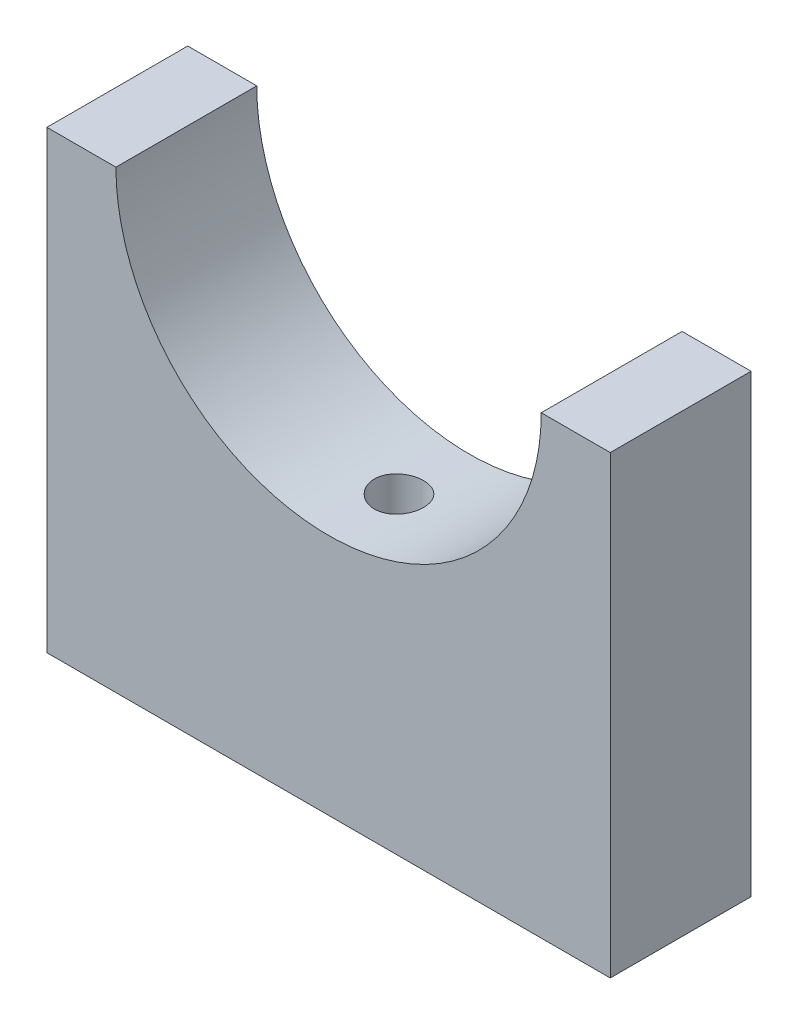
ISO-10303-21;
HEADER;
FILE_DESCRIPTION(('STEP AP214'),'2;1');
FILE_NAME('part.step','',(''),(''),'','','');
FILE_SCHEMA(('AUTOMOTIVE_DESIGN { 1 0 10303 214 1 1 1 1 }'));
ENDSEC;
DATA;
#1=APPLICATION_CONTEXT('core data for automotive mechanical design processes');
#2=APPLICATION_PROTOCOL_DEFINITION('international standard','automotive_design',2000,#1);
#3=PRODUCT_CONTEXT('',#1,'mechanical');
#4=PRODUCT('Part','Part','',(#3));
#5=PRODUCT_RELATED_PRODUCT_CATEGORY('part','',(#4));
#6=PRODUCT_DEFINITION_FORMATION('','',#4);
#7=PRODUCT_DEFINITION_CONTEXT('part definition',#1,'design');
#8=PRODUCT_DEFINITION('design','',#6,#7);
#9=PRODUCT_DEFINITION_SHAPE('','',#8);
#10=(LENGTH_UNIT() NAMED_UNIT(*) SI_UNIT(.MILLI.,.METRE.));
#11=(NAMED_UNIT(*) PLANE_ANGLE_UNIT() SI_UNIT($,.RADIAN.));
#12=(NAMED_UNIT(*) SI_UNIT($,.STERADIAN.) SOLID_ANGLE_UNIT());
#13=UNCERTAINTY_MEASURE_WITH_UNIT(LENGTH_MEASURE(1.E-05),#10,'distance_accuracy_value','');
#14=(GEOMETRIC_REPRESENTATION_CONTEXT(3) GLOBAL_UNCERTAINTY_ASSIGNED_CONTEXT((#13)) GLOBAL_UNIT_ASSIGNED_CONTEXT((#10,
#11,#12)) REPRESENTATION_CONTEXT('',''));
#15=CARTESIAN_POINT('',(0.,0.,0.));
#16=DIRECTION('',(0.,0.,1.));
#17=DIRECTION('',(1.,0.,0.));
#18=AXIS2_PLACEMENT_3D('',#15,#16,#17);
#19=CARTESIAN_POINT('',(-40.,32.31,10.));
#20=DIRECTION('',(0.,-1.,0.));
#21=DIRECTION('',(0.,0.,-1.));
#22=AXIS2_PLACEMENT_3D('',#19,#20,#21);
#23=PLANE('',#22);
#24=DIRECTION('',(-1.,0.,0.));
#25=VECTOR('',#24,1.);
#26=CARTESIAN_POINT('',(-40.,32.31,-10.));
#27=LINE('',#26,#25);
#28=CARTESIAN_POINT('',(40.,32.31,-10.));
#29=VERTEX_POINT('',#28);
#30=CARTESIAN_POINT('',(30.2,32.31,-10.));
#31=VERTEX_POINT('',#30);
#32=EDGE_CURVE('E107',#29,#31,#27,.T.);
#33=ORIENTED_EDGE('',*,*,#32,.T.);
#34=DIRECTION('',(0.,0.,1.));
#35=VECTOR('',#34,1.);
#36=CARTESIAN_POINT('',(30.2,32.31,-77.5292529204936));
#37=LINE('',#36,#35);
#38=CARTESIAN_POINT('',(30.2,32.31,10.));
#39=VERTEX_POINT('',#38);
#40=EDGE_CURVE('E55',#31,#39,#37,.T.);
#41=ORIENTED_EDGE('',*,*,#40,.T.);
#42=DIRECTION('',(-1.,0.,0.));
#43=VECTOR('',#42,1.);
#44=CARTESIAN_POINT('',(-40.,32.31,10.));
#45=LINE('',#44,#43);
#46=CARTESIAN_POINT('',(40.,32.31,10.));
#47=VERTEX_POINT('',#46);
#48=EDGE_CURVE('E91',#47,#39,#45,.T.);
#49=ORIENTED_EDGE('',*,*,#48,.F.);
#50=DIRECTION('',(0.,0.,-1.));
#51=VECTOR('',#50,1.);
#52=CARTESIAN_POINT('',(40.,32.31,10.));
#53=LINE('',#52,#51);
#54=EDGE_CURVE('E11',#47,#29,#53,.T.);
#55=ORIENTED_EDGE('',*,*,#54,.T.);
#56=EDGE_LOOP('',(#33,#41,#49,#55));
#57=FACE_BOUND('',#56,.T.);
#58=ADVANCED_FACE('F34',(#57),#23,.F.);
#59=CARTESIAN_POINT('',(40.,32.31,10.));
#60=DIRECTION('',(-1.,0.,0.));
#61=DIRECTION('',(0.,-1.,0.));
#62=AXIS2_PLACEMENT_3D('',#59,#60,#61);
#63=PLANE('',#62);
#64=DIRECTION('',(0.,1.,0.));
#65=VECTOR('',#64,1.);
#66=CARTESIAN_POINT('',(40.,32.31,-10.));
#67=LINE('',#66,#65);
#68=CARTESIAN_POINT('',(40.,-32.31,-10.));
#69=VERTEX_POINT('',#68);
#70=EDGE_CURVE('E121',#69,#29,#67,.T.);
#71=ORIENTED_EDGE('',*,*,#70,.T.);
#72=ORIENTED_EDGE('',*,*,#54,.F.);
#73=DIRECTION('',(0.,1.,0.));
#74=VECTOR('',#73,1.);
#75=CARTESIAN_POINT('',(40.,32.31,10.));
#76=LINE('',#75,#74);
#77=CARTESIAN_POINT('',(40.,-32.31,10.));
#78=VERTEX_POINT('',#77);
#79=EDGE_CURVE('E111',#78,#47,#76,.T.);
#80=ORIENTED_EDGE('',*,*,#79,.F.);
#81=DIRECTION('',(0.,0.,-1.));
#82=VECTOR('',#81,1.);
#83=CARTESIAN_POINT('',(40.,-32.31,10.));
#84=LINE('',#83,#82);
#85=EDGE_CURVE('E120',#78,#69,#84,.T.);
#86=ORIENTED_EDGE('',*,*,#85,.T.);
#87=EDGE_LOOP('',(#71,#72,#80,#86));
#88=FACE_BOUND('',#87,.T.);
#89=ADVANCED_FACE('F36',(#88),#63,.F.);
#90=CARTESIAN_POINT('',(-30.2,32.31,10.));
#91=VERTEX_POINT('',#90);
#92=CARTESIAN_POINT('',(-40.,32.31,10.));
#93=VERTEX_POINT('',#92);
#94=EDGE_CURVE('E114',#91,#93,#45,.T.);
#95=ORIENTED_EDGE('',*,*,#94,.F.);
#96=DIRECTION('',(0.,0.,1.));
#97=VECTOR('',#96,1.);
#98=CARTESIAN_POINT('',(-30.2,32.31,-77.5292529204936));
#99=LINE('',#98,#97);
#100=CARTESIAN_POINT('',(-30.2,32.31,-9.99999999999999));
#101=VERTEX_POINT('',#100);
#102=EDGE_CURVE('E103',#101,#91,#99,.T.);
#103=ORIENTED_EDGE('',*,*,#102,.F.);
#104=CARTESIAN_POINT('',(-40.,32.31,-10.));
#105=VERTEX_POINT('',#104);
#106=EDGE_CURVE('E124',#101,#105,#27,.T.);
#107=ORIENTED_EDGE('',*,*,#106,.T.);
#108=DIRECTION('',(0.,0.,-1.));
#109=VECTOR('',#108,1.);
#110=CARTESIAN_POINT('',(-40.,32.31,10.));
#111=LINE('',#110,#109);
#112=EDGE_CURVE('E48',#93,#105,#111,.T.);
#113=ORIENTED_EDGE('',*,*,#112,.F.);
#114=EDGE_LOOP('',(#95,#103,#107,#113));
#115=FACE_BOUND('',#114,.T.);
#116=ADVANCED_FACE('F155',(#115),#23,.F.);
#117=CARTESIAN_POINT('',(-40.,32.31,10.));
#118=DIRECTION('',(1.,0.,0.));
#119=DIRECTION('',(0.,1.,0.));
#120=AXIS2_PLACEMENT_3D('',#117,#118,#119);
#121=PLANE('',#120);
#122=DIRECTION('',(0.,-1.,0.));
#123=VECTOR('',#122,1.);
#124=CARTESIAN_POINT('',(-40.,32.31,-10.));
#125=LINE('',#124,#123);
#126=CARTESIAN_POINT('',(-40.,-32.31,-10.));
#127=VERTEX_POINT('',#126);
#128=EDGE_CURVE('E127',#105,#127,#125,.T.);
#129=ORIENTED_EDGE('',*,*,#128,.T.);
#130=DIRECTION('',(0.,0.,-1.));
#131=VECTOR('',#130,1.);
#132=CARTESIAN_POINT('',(-40.,-32.31,10.));
#133=LINE('',#132,#131);
#134=CARTESIAN_POINT('',(-40.,-32.31,10.));
#135=VERTEX_POINT('',#134);
#136=EDGE_CURVE('E131',#135,#127,#133,.T.);
#137=ORIENTED_EDGE('',*,*,#136,.F.);
#138=DIRECTION('',(0.,-1.,0.));
#139=VECTOR('',#138,1.);
#140=CARTESIAN_POINT('',(-40.,32.31,10.));
#141=LINE('',#140,#139);
#142=EDGE_CURVE('E113',#93,#135,#141,.T.);
#143=ORIENTED_EDGE('',*,*,#142,.F.);
#144=ORIENTED_EDGE('',*,*,#112,.T.);
#145=EDGE_LOOP('',(#129,#137,#143,#144));
#146=FACE_BOUND('',#145,.T.);
#147=ADVANCED_FACE('F138',(#146),#121,.F.);
#148=CARTESIAN_POINT('',(-40.,-32.31,10.));
#149=DIRECTION('',(0.,1.,0.));
#150=DIRECTION('',(0.,0.,1.));
#151=AXIS2_PLACEMENT_3D('',#148,#149,#150);
#152=PLANE('',#151);
#153=CARTESIAN_POINT('',(0.,-32.31,0.));
#154=DIRECTION('',(0.,-1.,0.));
#155=DIRECTION('',(0.,0.,-1.));
#156=AXIS2_PLACEMENT_3D('',#153,#154,#155);
#157=CIRCLE('',#156,3.49999999999999);
#158=CARTESIAN_POINT('',(0.,-32.31,-3.49999999999999));
#159=VERTEX_POINT('',#158);
#160=EDGE_CURVE('E169',#159,#159,#157,.T.);
#161=ORIENTED_EDGE('',*,*,#160,.F.);
#162=EDGE_LOOP('',(#161));
#163=FACE_BOUND('',#162,.T.);
#164=DIRECTION('',(1.,0.,0.));
#165=VECTOR('',#164,1.);
#166=CARTESIAN_POINT('',(-40.,-32.31,-10.));
#167=LINE('',#166,#165);
#168=EDGE_CURVE('E85',#127,#69,#167,.T.);
#169=ORIENTED_EDGE('',*,*,#168,.T.);
#170=ORIENTED_EDGE('',*,*,#85,.F.);
#171=DIRECTION('',(1.,0.,0.));
#172=VECTOR('',#171,1.);
#173=CARTESIAN_POINT('',(-40.,-32.31,10.));
#174=LINE('',#173,#172);
#175=EDGE_CURVE('E64',#135,#78,#174,.T.);
#176=ORIENTED_EDGE('',*,*,#175,.F.);
#177=ORIENTED_EDGE('',*,*,#136,.T.);
#178=EDGE_LOOP('',(#169,#170,#176,#177));
#179=FACE_BOUND('',#178,.T.);
#180=ADVANCED_FACE('F146',(#163,#179),#152,.F.);
#181=CARTESIAN_POINT('',(0.,0.,10.));
#182=DIRECTION('',(0.,0.,1.));
#183=DIRECTION('',(1.,0.,0.));
#184=AXIS2_PLACEMENT_3D('',#181,#182,#183);
#185=PLANE('',#184);
#186=CARTESIAN_POINT('',(0.,32.31,10.));
#187=DIRECTION('',(0.,0.,1.));
#188=DIRECTION('',(1.,0.,0.));
#189=AXIS2_PLACEMENT_3D('',#186,#187,#188);
#190=CIRCLE('',#189,30.2);
#191=EDGE_CURVE('E100',#91,#39,#190,.T.);
#192=ORIENTED_EDGE('',*,*,#191,.F.);
#193=ORIENTED_EDGE('',*,*,#94,.T.);
#194=ORIENTED_EDGE('',*,*,#142,.T.);
#195=ORIENTED_EDGE('',*,*,#175,.T.);
#196=ORIENTED_EDGE('',*,*,#79,.T.);
#197=ORIENTED_EDGE('',*,*,#48,.T.);
#198=EDGE_LOOP('',(#192,#193,#194,#195,#196,#197));
#199=FACE_BOUND('',#198,.T.);
#200=ADVANCED_FACE('F109',(#199),#185,.T.);
#201=CARTESIAN_POINT('',(0.,0.,-10.));
#202=DIRECTION('',(0.,0.,1.));
#203=DIRECTION('',(1.,0.,0.));
#204=AXIS2_PLACEMENT_3D('',#201,#202,#203);
#205=PLANE('',#204);
#206=ORIENTED_EDGE('',*,*,#106,.F.);
#207=CARTESIAN_POINT('',(0.,32.31,-9.99999999999999));
#208=DIRECTION('',(0.,0.,1.));
#209=DIRECTION('',(1.,0.,0.));
#210=AXIS2_PLACEMENT_3D('',#207,#208,#209);
#211=CIRCLE('',#210,30.2);
#212=EDGE_CURVE('E125',#31,#101,#211,.F.);
#213=ORIENTED_EDGE('',*,*,#212,.F.);
#214=ORIENTED_EDGE('',*,*,#32,.F.);
#215=ORIENTED_EDGE('',*,*,#70,.F.);
#216=ORIENTED_EDGE('',*,*,#168,.F.);
#217=ORIENTED_EDGE('',*,*,#128,.F.);
#218=EDGE_LOOP('',(#206,#213,#214,#215,#216,#217));
#219=FACE_BOUND('',#218,.T.);
#220=ADVANCED_FACE('F143',(#219),#205,.F.);
#221=CARTESIAN_POINT('',(0.,32.31,-77.5292529204936));
#222=DIRECTION('',(0.,0.,1.));
#223=DIRECTION('',(1.,0.,0.));
#224=AXIS2_PLACEMENT_3D('',#221,#222,#223);
#225=CYLINDRICAL_SURFACE('',#224,30.2);
#226=CARTESIAN_POINT('',(0.,2.11000000000002,-3.49999999999999));
#227=CARTESIAN_POINT('',(0.195891918571153,2.11000256581041,-3.49999161108982));
#228=CARTESIAN_POINT('',(0.391909020957974,2.11192615329625,-3.48349873261777));
#229=CARTESIAN_POINT('',(0.778496581175896,2.11941472141884,-3.41796131970982));
#230=CARTESIAN_POINT('',(0.96906100316766,2.12498358591819,-3.36888206530055));
#231=CARTESIAN_POINT('',(1.33908998327034,2.13913485289083,-3.23963055538984));
#232=CARTESIAN_POINT('',(1.51856162835173,2.14771530741232,-3.15947839492041));
#233=CARTESIAN_POINT('',(1.86146951226705,2.16693344185814,-2.97039839721604));
#234=CARTESIAN_POINT('',(2.02490866423028,2.17757074700194,-2.86147580094587));
#235=CARTESIAN_POINT('',(2.33192680186254,2.19977006959158,-2.61739136228097));
#236=CARTESIAN_POINT('',(2.47541848147884,2.21133582289555,-2.48212003218197));
#237=CARTESIAN_POINT('',(2.73771710458983,2.23405809277781,-2.18941262439543));
#238=CARTESIAN_POINT('',(2.85652283691805,2.24521458925463,-2.03197545982112));
#239=CARTESIAN_POINT('',(3.06639667959235,2.26589235209991,-1.69884545599625));
#240=CARTESIAN_POINT('',(3.15738398890635,2.2754088205796,-1.52310138821078));
#241=CARTESIAN_POINT('',(3.30852223023106,2.29168070196845,-1.1586996419795));
#242=CARTESIAN_POINT('',(3.36867417151938,2.29843620524577,-0.970042386426532));
#243=CARTESIAN_POINT('',(3.45617115247823,2.30838619050141,-0.58607042915753));
#244=CARTESIAN_POINT('',(3.48366273177283,2.31159657401516,-0.390789539056947));
#245=CARTESIAN_POINT('',(3.50551187041999,2.3141417132123,0.00163869396384032));
#246=CARTESIAN_POINT('',(3.49987058174422,2.31347660363979,0.198785971755082));
#247=CARTESIAN_POINT('',(3.4557345955798,2.30836045143354,0.588333787866005));
#248=CARTESIAN_POINT('',(3.41740076033599,2.30392794646535,0.780752829888896));
#249=CARTESIAN_POINT('',(3.30921855549369,2.29180535548937,1.15640812882882));
#250=CARTESIAN_POINT('',(3.23936962971762,2.28411521199101,1.33964422362201));
#251=CARTESIAN_POINT('',(3.06996528645336,2.26632267222309,1.69223524934872));
#252=CARTESIAN_POINT('',(2.97033939562431,2.25621456480188,1.86155602103269));
#253=CARTESIAN_POINT('',(2.74425963336991,2.23472958059492,2.18113589625077));
#254=CARTESIAN_POINT('',(2.61780470662441,2.22335265390852,2.33139424959301));
#255=CARTESIAN_POINT('',(2.34076224969454,2.20052941584164,2.60951812222652));
#256=CARTESIAN_POINT('',(2.19003595838436,2.18908309337278,2.73724545970409));
#257=CARTESIAN_POINT('',(1.86920868436072,2.1674741494565,2.96560759208921));
#258=CARTESIAN_POINT('',(1.69910766697651,2.15731153030633,3.06624233851394));
#259=CARTESIAN_POINT('',(1.34425713710024,2.13940995590963,3.23756053522435));
#260=CARTESIAN_POINT('',(1.15950372166893,2.1316716491595,3.30823597326557));
#261=CARTESIAN_POINT('',(0.780642439771141,2.11949671662946,3.41752293354481));
#262=CARTESIAN_POINT('',(0.586534949787654,2.11505995808673,3.4561357451016));
#263=CARTESIAN_POINT('',(0.195671026225153,2.11000519503292,3.50002376181485));
#264=CARTESIAN_POINT('',(-0.00106374868210989,2.10936537199226,3.50548944603875));
#265=CARTESIAN_POINT('',(-0.392646449329137,2.11191781812773,3.48342980374682));
#266=CARTESIAN_POINT('',(-0.587494409432122,2.11511001738113,3.45590507920541));
#267=CARTESIAN_POINT('',(-0.969215198127674,2.12495411520807,3.36880410773316));
#268=CARTESIAN_POINT('',(-1.15610887790144,2.13159627713085,3.30931804743546));
#269=CARTESIAN_POINT('',(-1.51726657459986,2.14759610729493,3.16007633613222));
#270=CARTESIAN_POINT('',(-1.69153021808938,2.15695385578769,3.07031979055565));
#271=CARTESIAN_POINT('',(-2.02333594767006,2.17739469822579,2.86261962688974));
#272=CARTESIAN_POINT('',(-2.18079996254785,2.1884853034685,2.74455203987222));
#273=CARTESIAN_POINT('',(-2.47374387604449,2.21112594257532,2.48375759659619));
#274=CARTESIAN_POINT('',(-2.60922302805319,2.22267599202567,2.34102990321546));
#275=CARTESIAN_POINT('',(-2.8550216738889,2.24500043999306,2.03413074831125));
#276=CARTESIAN_POINT('',(-2.96521538361343,2.25577078570224,1.86985820781135));
#277=CARTESIAN_POINT('',(-3.15644785719034,2.27525152946643,1.52502605623463));
#278=CARTESIAN_POINT('',(-3.23748713502723,2.28396196383616,1.34446673235946));
#279=CARTESIAN_POINT('',(-3.36790397953522,2.2983098304227,0.972602199658676));
#280=CARTESIAN_POINT('',(-3.41735398784845,2.30395428915824,0.781322679436645));
#281=CARTESIAN_POINT('',(-3.48342259888647,2.31155185766366,0.393105905125999));
#282=CARTESIAN_POINT('',(-3.50004249848639,2.3135051132456,0.196168874835629));
#283=CARTESIAN_POINT('',(-3.49995758884181,2.31349530502946,-0.196521751267812));
#284=CARTESIAN_POINT('',(-3.48345037178444,2.31155546225983,-0.392275420003576));
#285=CARTESIAN_POINT('',(-3.41799662537763,2.30402778857166,-0.778207106721096));
#286=CARTESIAN_POINT('',(-3.3690500783076,2.29843995566035,-0.968385121656992));
#287=CARTESIAN_POINT('',(-3.24016611698172,2.28425279875974,-1.33775045227317));
#288=CARTESIAN_POINT('',(-3.160236801665,2.27565426182947,-1.51694062602486));
#289=CARTESIAN_POINT('',(-2.97167584008224,2.2564131109692,-1.85939575443407));
#290=CARTESIAN_POINT('',(-2.86304403505612,2.24577048573298,-2.02266062099821));
#291=CARTESIAN_POINT('',(-2.61942459800235,2.22356420044073,-2.32964209713426));
#292=CARTESIAN_POINT('',(-2.48428958652468,2.21199561459825,-2.47324139677996));
#293=CARTESIAN_POINT('',(-2.19180307977574,2.1892850586426,-2.73580432925958));
#294=CARTESIAN_POINT('',(-2.03444632380727,2.1781431903453,-2.8547621120504));
#295=CARTESIAN_POINT('',(-1.70139765904772,2.15750170903975,-3.06499043708891));
#296=CARTESIAN_POINT('',(-1.52564712576193,2.14800762015659,-3.15616859233233));
#297=CARTESIAN_POINT('',(-1.16132318462649,2.13178861103121,-3.3075912028382));
#298=CARTESIAN_POINT('',(-0.972764176646557,2.12506063912245,-3.36786976572117));
#299=CARTESIAN_POINT('',(-0.652660482073518,2.11678069668297,-3.44111739981687));
#300=CARTESIAN_POINT('',(-0.523145833081872,2.11425011484167,-3.46316725714043));
#301=CARTESIAN_POINT('',(-0.262439514410298,2.11085891197709,-3.49261132342184));
#302=CARTESIAN_POINT('',(-0.131247854827916,2.10999828090353,-3.50000562058134));
#303=CARTESIAN_POINT('',(0.,2.11000000000002,-3.49999999999999));
#304=B_SPLINE_CURVE_WITH_KNOTS('',3,(#226,#227,#228,#229,#230,#231,#232,#233,#234,#235,#236,
#237,#238,#239,#240,#241,#242,#243,#244,#245,#246,#247,#248,#249,#250,#251,#252,#253,#254,#255,
#256,#257,#258,#259,#260,#261,#262,#263,#264,#265,#266,#267,#268,#269,#270,#271,#272,#273,#274,
#275,#276,#277,#278,#279,#280,#281,#282,#283,#284,#285,#286,#287,#288,#289,#290,#291,#292,#293,
#294,#295,#296,#297,#298,#299,#300,#301,#302,#303),.UNSPECIFIED.,.T.,.F.,(4,2,2,2,2,2,2,2,2,2,2,
2,2,2,2,2,2,2,2,2,2,2,2,2,2,2,2,2,2,2,2,2,2,2,2,2,2,2,4),(0.,0.587196404094642,1.17501945751214,
1.76246299473872,2.34979959406089,2.93963094287045,3.52949122374216,4.12104887556853,
4.71258716378555,5.30146120787558,5.89031477796994,6.47628752674615,7.0622706171602,
7.64965168969231,8.23705587114462,8.82794599536716,9.41883717699402,10.0098862855729,
10.6009116254307,11.1885374112556,11.7761524748641,12.3621180822689,12.948101007989,
13.5366982731369,14.1253155229792,14.7168003040571,15.3082746569123,15.8983877037366,
16.4884774390865,17.075057947538,17.6616387764201,18.2480663755393,18.8344972183922,
19.4242866112176,20.0142158634939,20.6060861564861,21.1973017161211,21.5907264821191,
21.984148880359),.UNSPECIFIED.);
#305=CARTESIAN_POINT('',(0.,2.11000000000002,-3.49999999999999));
#306=VERTEX_POINT('',#305);
#307=EDGE_CURVE('E38',#306,#306,#304,.T.);
#308=ORIENTED_EDGE('',*,*,#307,.T.);
#309=EDGE_LOOP('',(#308));
#310=FACE_BOUND('',#309,.T.);
#311=ORIENTED_EDGE('',*,*,#212,.T.);
#312=ORIENTED_EDGE('',*,*,#102,.T.);
#313=ORIENTED_EDGE('',*,*,#191,.T.);
#314=ORIENTED_EDGE('',*,*,#40,.F.);
#315=EDGE_LOOP('',(#311,#312,#313,#314));
#316=FACE_BOUND('',#315,.T.);
#317=ADVANCED_FACE('F101',(#310,#316),#225,.F.);
#318=CARTESIAN_POINT('',(0.,-32.31,0.));
#319=DIRECTION('',(0.,-1.,0.));
#320=DIRECTION('',(0.,0.,-1.));
#321=AXIS2_PLACEMENT_3D('',#318,#319,#320);
#322=CYLINDRICAL_SURFACE('',#321,3.49999999999999);
#323=ORIENTED_EDGE('',*,*,#160,.T.);
#324=EDGE_LOOP('',(#323));
#325=FACE_BOUND('',#324,.T.);
#326=ORIENTED_EDGE('',*,*,#307,.F.);
#327=EDGE_LOOP('',(#326));
#328=FACE_BOUND('',#327,.T.);
#329=ADVANCED_FACE('F176',(#325,#328),#322,.F.);
#330=CLOSED_SHELL('',(#58,#89,#116,#147,#180,#200,#220,#317,#329));
#331=MANIFOLD_SOLID_BREP('B2',#330);
#332=ADVANCED_BREP_SHAPE_REPRESENTATION('',(#18,#331),#14);
#333=SHAPE_DEFINITION_REPRESENTATION(#9,#332);
ENDSEC;
END-ISO-10303-21;
